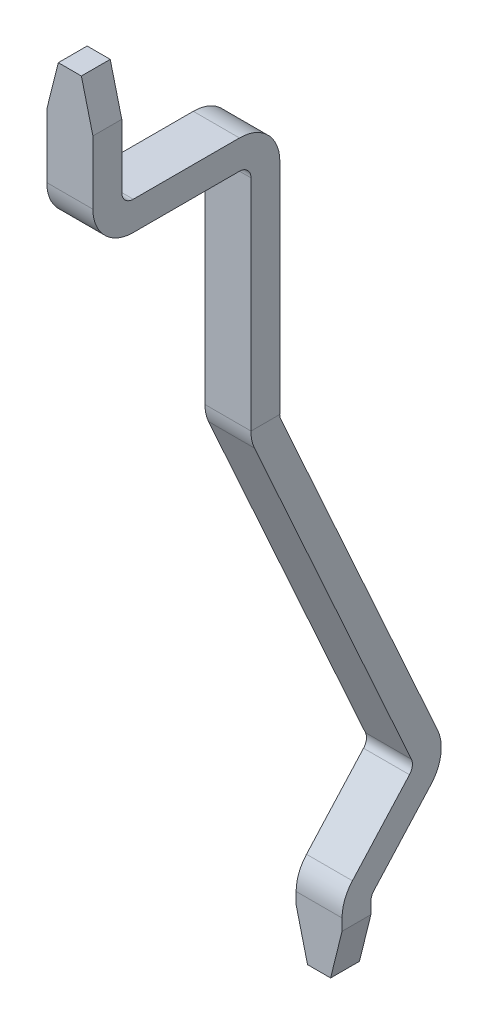
ISO-10303-21;
HEADER;
FILE_DESCRIPTION(('STEP AP214'),'2;1');
FILE_NAME('part.step','',(''),(''),'','','');
FILE_SCHEMA(('AUTOMOTIVE_DESIGN { 1 0 10303 214 1 1 1 1 }'));
ENDSEC;
DATA;
#1=APPLICATION_CONTEXT('core data for automotive mechanical design processes');
#2=APPLICATION_PROTOCOL_DEFINITION('international standard','automotive_design',2000,#1);
#3=PRODUCT_CONTEXT('',#1,'mechanical');
#4=PRODUCT('Part','Part','',(#3));
#5=PRODUCT_RELATED_PRODUCT_CATEGORY('part','',(#4));
#6=PRODUCT_DEFINITION_FORMATION('','',#4);
#7=PRODUCT_DEFINITION_CONTEXT('part definition',#1,'design');
#8=PRODUCT_DEFINITION('design','',#6,#7);
#9=PRODUCT_DEFINITION_SHAPE('','',#8);
#10=(LENGTH_UNIT() NAMED_UNIT(*) SI_UNIT(.MILLI.,.METRE.));
#11=(NAMED_UNIT(*) PLANE_ANGLE_UNIT() SI_UNIT($,.RADIAN.));
#12=(NAMED_UNIT(*) SI_UNIT($,.STERADIAN.) SOLID_ANGLE_UNIT());
#13=UNCERTAINTY_MEASURE_WITH_UNIT(LENGTH_MEASURE(1.E-05),#10,'distance_accuracy_value','');
#14=(GEOMETRIC_REPRESENTATION_CONTEXT(3) GLOBAL_UNCERTAINTY_ASSIGNED_CONTEXT((#13)) GLOBAL_UNIT_ASSIGNED_CONTEXT((#10,
#11,#12)) REPRESENTATION_CONTEXT('',''));
#15=CARTESIAN_POINT('',(0.,0.,0.));
#16=DIRECTION('',(0.,0.,1.));
#17=DIRECTION('',(1.,0.,0.));
#18=AXIS2_PLACEMENT_3D('',#15,#16,#17);
#19=CARTESIAN_POINT('',(0.80000000000001,4.575,1.945));
#20=DIRECTION('',(0.,-1.,0.));
#21=DIRECTION('',(0.,0.,-1.));
#22=AXIS2_PLACEMENT_3D('',#19,#20,#21);
#23=PLANE('',#22);
#24=DIRECTION('',(0.,0.,1.));
#25=VECTOR('',#24,1.);
#26=CARTESIAN_POINT('',(0.70000000000001,4.575,8.99552393868072));
#27=LINE('',#26,#25);
#28=CARTESIAN_POINT('',(0.70000000000001,4.575,1.82));
#29=VERTEX_POINT('',#28);
#30=CARTESIAN_POINT('',(0.70000000000001,4.575,2.07));
#31=VERTEX_POINT('',#30);
#32=EDGE_CURVE('E264',#29,#31,#27,.T.);
#33=ORIENTED_EDGE('',*,*,#32,.T.);
#34=DIRECTION('',(-1.,0.,0.));
#35=VECTOR('',#34,1.);
#36=CARTESIAN_POINT('',(1.00000000000001,4.575,2.07));
#37=LINE('',#36,#35);
#38=CARTESIAN_POINT('',(0.90000000000001,4.575,2.07));
#39=VERTEX_POINT('',#38);
#40=EDGE_CURVE('E235',#31,#39,#37,.F.);
#41=ORIENTED_EDGE('',*,*,#40,.T.);
#42=DIRECTION('',(0.,0.,1.));
#43=VECTOR('',#42,1.);
#44=CARTESIAN_POINT('',(0.90000000000001,4.575,8.99552883706733));
#45=LINE('',#44,#43);
#46=CARTESIAN_POINT('',(0.90000000000001,4.575,1.82));
#47=VERTEX_POINT('',#46);
#48=EDGE_CURVE('E214',#47,#39,#45,.T.);
#49=ORIENTED_EDGE('',*,*,#48,.F.);
#50=DIRECTION('',(1.,0.,0.));
#51=VECTOR('',#50,1.);
#52=CARTESIAN_POINT('',(0.60000000000001,4.575,1.82));
#53=LINE('',#52,#51);
#54=EDGE_CURVE('E251',#47,#29,#53,.F.);
#55=ORIENTED_EDGE('',*,*,#54,.T.);
#56=EDGE_LOOP('',(#33,#41,#49,#55));
#57=FACE_BOUND('',#56,.T.);
#58=ADVANCED_FACE('F17',(#57),#23,.F.);
#59=CARTESIAN_POINT('',(0.70000000000001,4.575,8.99552393868072));
#60=DIRECTION('',(0.970142500145331,-0.242535625036336,0.));
#61=DIRECTION('',(0.242535625036336,0.970142500145331,0.));
#62=AXIS2_PLACEMENT_3D('',#59,#60,#61);
#63=PLANE('',#62);
#64=DIRECTION('',(0.242535625036333,0.970142500145332,0.));
#65=VECTOR('',#64,1.);
#66=CARTESIAN_POINT('',(0.60000000000001,4.175,2.07));
#67=LINE('',#66,#65);
#68=CARTESIAN_POINT('',(0.60000000000001,4.175,2.07));
#69=VERTEX_POINT('',#68);
#70=EDGE_CURVE('E202',#69,#31,#67,.T.);
#71=ORIENTED_EDGE('',*,*,#70,.T.);
#72=ORIENTED_EDGE('',*,*,#32,.F.);
#73=DIRECTION('',(-0.242535625036333,-0.970142500145332,0.));
#74=VECTOR('',#73,1.);
#75=CARTESIAN_POINT('',(0.70000000000001,4.575,1.82));
#76=LINE('',#75,#74);
#77=CARTESIAN_POINT('',(0.60000000000001,4.175,1.82));
#78=VERTEX_POINT('',#77);
#79=EDGE_CURVE('E231',#29,#78,#76,.T.);
#80=ORIENTED_EDGE('',*,*,#79,.T.);
#81=DIRECTION('',(0.,0.,1.));
#82=VECTOR('',#81,1.);
#83=CARTESIAN_POINT('',(0.60000000000001,4.175,2.07));
#84=LINE('',#83,#82);
#85=EDGE_CURVE('E242',#78,#69,#84,.T.);
#86=ORIENTED_EDGE('',*,*,#85,.T.);
#87=EDGE_LOOP('',(#71,#72,#80,#86));
#88=FACE_BOUND('',#87,.T.);
#89=ADVANCED_FACE('F401',(#88),#63,.F.);
#90=CARTESIAN_POINT('',(0.60000000000001,4.575,1.82));
#91=DIRECTION('',(0.,0.,1.));
#92=DIRECTION('',(0.,-1.,0.));
#93=AXIS2_PLACEMENT_3D('',#90,#91,#92);
#94=PLANE('',#93);
#95=ORIENTED_EDGE('',*,*,#79,.F.);
#96=ORIENTED_EDGE('',*,*,#54,.F.);
#97=DIRECTION('',(-0.242535625036336,0.970142500145331,0.));
#98=VECTOR('',#97,1.);
#99=CARTESIAN_POINT('',(0.90000000000001,4.575,1.82));
#100=LINE('',#99,#98);
#101=CARTESIAN_POINT('',(1.00000000000001,4.175,1.82));
#102=VERTEX_POINT('',#101);
#103=EDGE_CURVE('E232',#102,#47,#100,.T.);
#104=ORIENTED_EDGE('',*,*,#103,.F.);
#105=DIRECTION('',(0.,1.,0.));
#106=VECTOR('',#105,1.);
#107=CARTESIAN_POINT('',(1.00000000000001,4.575,1.82));
#108=LINE('',#107,#106);
#109=CARTESIAN_POINT('',(1.00000000000001,3.625,1.82));
#110=VERTEX_POINT('',#109);
#111=EDGE_CURVE('E221',#102,#110,#108,.F.);
#112=ORIENTED_EDGE('',*,*,#111,.T.);
#113=DIRECTION('',(1.,0.,0.));
#114=VECTOR('',#113,1.);
#115=CARTESIAN_POINT('',(0.80000000000001,3.625,1.81999999999999));
#116=LINE('',#115,#114);
#117=CARTESIAN_POINT('',(0.60000000000001,3.625,1.82));
#118=VERTEX_POINT('',#117);
#119=EDGE_CURVE('E229',#110,#118,#116,.F.);
#120=ORIENTED_EDGE('',*,*,#119,.T.);
#121=DIRECTION('',(0.,1.,0.));
#122=VECTOR('',#121,1.);
#123=CARTESIAN_POINT('',(0.60000000000001,4.575,1.82));
#124=LINE('',#123,#122);
#125=EDGE_CURVE('E246',#118,#78,#124,.T.);
#126=ORIENTED_EDGE('',*,*,#125,.T.);
#127=EDGE_LOOP('',(#95,#96,#104,#112,#120,#126));
#128=FACE_BOUND('',#127,.T.);
#129=ADVANCED_FACE('F396',(#128),#94,.F.);
#130=CARTESIAN_POINT('',(0.80000000000001,3.625,1.72));
#131=DIRECTION('',(1.,0.,0.));
#132=DIRECTION('',(0.,1.,0.));
#133=AXIS2_PLACEMENT_3D('',#130,#131,#132);
#134=CYLINDRICAL_SURFACE('',#133,0.0999999999999946);
#135=ORIENTED_EDGE('',*,*,#119,.F.);
#136=CARTESIAN_POINT('',(1.00000000000001,3.625,1.72));
#137=DIRECTION('',(1.,0.,0.));
#138=DIRECTION('',(0.,1.,0.));
#139=AXIS2_PLACEMENT_3D('',#136,#137,#138);
#140=CIRCLE('',#139,0.0999999999999946);
#141=CARTESIAN_POINT('',(1.00000000000001,3.525,1.72));
#142=VERTEX_POINT('',#141);
#143=EDGE_CURVE('E335',#110,#142,#140,.T.);
#144=ORIENTED_EDGE('',*,*,#143,.T.);
#145=DIRECTION('',(1.,0.,0.));
#146=VECTOR('',#145,1.);
#147=CARTESIAN_POINT('',(0.60000000000001,3.525,1.72));
#148=LINE('',#147,#146);
#149=CARTESIAN_POINT('',(0.60000000000001,3.525,1.72));
#150=VERTEX_POINT('',#149);
#151=EDGE_CURVE('E227',#142,#150,#148,.F.);
#152=ORIENTED_EDGE('',*,*,#151,.T.);
#153=CARTESIAN_POINT('',(0.60000000000001,3.625,1.72));
#154=DIRECTION('',(1.,0.,0.));
#155=DIRECTION('',(0.,1.,0.));
#156=AXIS2_PLACEMENT_3D('',#153,#154,#155);
#157=CIRCLE('',#156,0.0999999999999946);
#158=EDGE_CURVE('E340',#150,#118,#157,.F.);
#159=ORIENTED_EDGE('',*,*,#158,.T.);
#160=EDGE_LOOP('',(#135,#144,#152,#159));
#161=FACE_BOUND('',#160,.T.);
#162=ADVANCED_FACE('F393',(#161),#134,.F.);
#163=CARTESIAN_POINT('',(0.60000000000001,3.525,1.72));
#164=DIRECTION('',(0.,-1.,0.));
#165=DIRECTION('',(0.,0.,-1.));
#166=AXIS2_PLACEMENT_3D('',#163,#164,#165);
#167=PLANE('',#166);
#168=ORIENTED_EDGE('',*,*,#151,.F.);
#169=DIRECTION('',(0.,0.,1.));
#170=VECTOR('',#169,1.);
#171=CARTESIAN_POINT('',(1.00000000000001,3.525,1.82));
#172=LINE('',#171,#170);
#173=CARTESIAN_POINT('',(1.00000000000001,3.525,0.800000000000004));
#174=VERTEX_POINT('',#173);
#175=EDGE_CURVE('E334',#142,#174,#172,.F.);
#176=ORIENTED_EDGE('',*,*,#175,.T.);
#177=DIRECTION('',(-1.,0.,0.));
#178=VECTOR('',#177,1.);
#179=CARTESIAN_POINT('',(0.80000000000001,3.525,0.800000000000004));
#180=LINE('',#179,#178);
#181=CARTESIAN_POINT('',(0.60000000000001,3.525,0.800000000000004));
#182=VERTEX_POINT('',#181);
#183=EDGE_CURVE('E178',#182,#174,#180,.F.);
#184=ORIENTED_EDGE('',*,*,#183,.F.);
#185=DIRECTION('',(0.,0.,1.));
#186=VECTOR('',#185,1.);
#187=CARTESIAN_POINT('',(0.60000000000001,3.525,2.07));
#188=LINE('',#187,#186);
#189=EDGE_CURVE('E343',#182,#150,#188,.T.);
#190=ORIENTED_EDGE('',*,*,#189,.T.);
#191=EDGE_LOOP('',(#168,#176,#184,#190));
#192=FACE_BOUND('',#191,.T.);
#193=ADVANCED_FACE('F384',(#192),#167,.F.);
#194=CARTESIAN_POINT('',(0.80000000000001,3.175,0.800000000000004));
#195=DIRECTION('',(-1.,0.,0.));
#196=DIRECTION('',(0.,-1.,0.));
#197=AXIS2_PLACEMENT_3D('',#194,#195,#196);
#198=CYLINDRICAL_SURFACE('',#197,0.350000000000005);
#199=CARTESIAN_POINT('',(1.00000000000001,3.175,0.800000000000004));
#200=DIRECTION('',(-1.,0.,0.));
#201=DIRECTION('',(0.,-1.,0.));
#202=AXIS2_PLACEMENT_3D('',#199,#200,#201);
#203=CIRCLE('',#202,0.350000000000005);
#204=CARTESIAN_POINT('',(1.00000000000001,3.175,0.45));
#205=VERTEX_POINT('',#204);
#206=EDGE_CURVE('E330',#174,#205,#203,.T.);
#207=ORIENTED_EDGE('',*,*,#206,.T.);
#208=DIRECTION('',(1.,0.,0.));
#209=VECTOR('',#208,1.);
#210=CARTESIAN_POINT('',(0.60000000000001,3.175,0.45));
#211=LINE('',#210,#209);
#212=CARTESIAN_POINT('',(0.60000000000001,3.175,0.45));
#213=VERTEX_POINT('',#212);
#214=EDGE_CURVE('E218',#205,#213,#211,.F.);
#215=ORIENTED_EDGE('',*,*,#214,.T.);
#216=CARTESIAN_POINT('',(0.60000000000001,3.175,0.800000000000004));
#217=DIRECTION('',(-1.,0.,0.));
#218=DIRECTION('',(0.,-1.,0.));
#219=AXIS2_PLACEMENT_3D('',#216,#217,#218);
#220=CIRCLE('',#219,0.350000000000005);
#221=EDGE_CURVE('E188',#213,#182,#220,.F.);
#222=ORIENTED_EDGE('',*,*,#221,.T.);
#223=ORIENTED_EDGE('',*,*,#183,.T.);
#224=EDGE_LOOP('',(#207,#215,#222,#223));
#225=FACE_BOUND('',#224,.T.);
#226=ADVANCED_FACE('F389',(#225),#198,.T.);
#227=CARTESIAN_POINT('',(0.60000000000001,3.175,0.45));
#228=DIRECTION('',(0.,0.,1.));
#229=DIRECTION('',(0.,-1.,0.));
#230=AXIS2_PLACEMENT_3D('',#227,#228,#229);
#231=PLANE('',#230);
#232=ORIENTED_EDGE('',*,*,#214,.F.);
#233=DIRECTION('',(0.,1.,0.));
#234=VECTOR('',#233,1.);
#235=CARTESIAN_POINT('',(1.00000000000001,4.575,0.449999999999999));
#236=LINE('',#235,#234);
#237=CARTESIAN_POINT('',(1.00000000000001,1.275,0.449999999999999));
#238=VERTEX_POINT('',#237);
#239=EDGE_CURVE('E333',#205,#238,#236,.F.);
#240=ORIENTED_EDGE('',*,*,#239,.T.);
#241=DIRECTION('',(1.,0.,0.));
#242=VECTOR('',#241,1.);
#243=CARTESIAN_POINT('',(0.999,1.275,0.449999999999998));
#244=LINE('',#243,#242);
#245=CARTESIAN_POINT('',(0.999000000000006,1.275,0.449999999999999));
#246=VERTEX_POINT('',#245);
#247=EDGE_CURVE('E224',#246,#238,#244,.T.);
#248=ORIENTED_EDGE('',*,*,#247,.F.);
#249=DIRECTION('',(1.,0.,0.));
#250=VECTOR('',#249,1.);
#251=CARTESIAN_POINT('',(0.60000000000001,1.275,0.45));
#252=LINE('',#251,#250);
#253=CARTESIAN_POINT('',(0.601000000000015,1.275,0.449999999999999));
#254=VERTEX_POINT('',#253);
#255=EDGE_CURVE('E174',#254,#246,#252,.T.);
#256=ORIENTED_EDGE('',*,*,#255,.F.);
#257=DIRECTION('',(1.,0.,0.));
#258=VECTOR('',#257,1.);
#259=CARTESIAN_POINT('',(0.601000000000014,1.275,0.45));
#260=LINE('',#259,#258);
#261=CARTESIAN_POINT('',(0.60000000000001,1.275,0.45));
#262=VERTEX_POINT('',#261);
#263=EDGE_CURVE('E20',#262,#254,#260,.T.);
#264=ORIENTED_EDGE('',*,*,#263,.F.);
#265=DIRECTION('',(0.,1.,0.));
#266=VECTOR('',#265,1.);
#267=CARTESIAN_POINT('',(0.60000000000001,4.575,0.45));
#268=LINE('',#267,#266);
#269=EDGE_CURVE('E172',#262,#213,#268,.T.);
#270=ORIENTED_EDGE('',*,*,#269,.T.);
#271=EDGE_LOOP('',(#232,#240,#248,#256,#264,#270));
#272=FACE_BOUND('',#271,.T.);
#273=ADVANCED_FACE('F171',(#272),#231,.F.);
#274=CARTESIAN_POINT('',(1.00000000000001,3.275,1.72));
#275=DIRECTION('',(0.,1.,0.));
#276=DIRECTION('',(0.,0.,1.));
#277=AXIS2_PLACEMENT_3D('',#274,#275,#276);
#278=PLANE('',#277);
#279=DIRECTION('',(1.,0.,0.));
#280=VECTOR('',#279,1.);
#281=CARTESIAN_POINT('',(0.80000000000001,3.27500000000001,1.72));
#282=LINE('',#281,#280);
#283=CARTESIAN_POINT('',(0.60000000000001,3.275,1.72));
#284=VERTEX_POINT('',#283);
#285=CARTESIAN_POINT('',(1.00000000000001,3.275,1.72));
#286=VERTEX_POINT('',#285);
#287=EDGE_CURVE('E203',#284,#286,#282,.T.);
#288=ORIENTED_EDGE('',*,*,#287,.F.);
#289=DIRECTION('',(0.,0.,1.));
#290=VECTOR('',#289,1.);
#291=CARTESIAN_POINT('',(0.60000000000001,3.275,2.07));
#292=LINE('',#291,#290);
#293=CARTESIAN_POINT('',(0.60000000000001,3.275,0.800000000000004));
#294=VERTEX_POINT('',#293);
#295=EDGE_CURVE('E194',#284,#294,#292,.F.);
#296=ORIENTED_EDGE('',*,*,#295,.T.);
#297=DIRECTION('',(-1.,0.,0.));
#298=VECTOR('',#297,1.);
#299=CARTESIAN_POINT('',(0.80000000000001,3.275,0.800000000000004));
#300=LINE('',#299,#298);
#301=CARTESIAN_POINT('',(1.00000000000001,3.275,0.800000000000004));
#302=VERTEX_POINT('',#301);
#303=EDGE_CURVE('E219',#294,#302,#300,.F.);
#304=ORIENTED_EDGE('',*,*,#303,.T.);
#305=DIRECTION('',(0.,0.,1.));
#306=VECTOR('',#305,1.);
#307=CARTESIAN_POINT('',(1.00000000000001,3.275,1.82));
#308=LINE('',#307,#306);
#309=EDGE_CURVE('E325',#302,#286,#308,.T.);
#310=ORIENTED_EDGE('',*,*,#309,.T.);
#311=EDGE_LOOP('',(#288,#296,#304,#310));
#312=FACE_BOUND('',#311,.T.);
#313=ADVANCED_FACE('F535',(#312),#278,.F.);
#314=CARTESIAN_POINT('',(0.80000000000001,3.625,1.72));
#315=DIRECTION('',(1.,0.,0.));
#316=DIRECTION('',(0.,1.,0.));
#317=AXIS2_PLACEMENT_3D('',#314,#315,#316);
#318=CYLINDRICAL_SURFACE('',#317,0.349999999999995);
#319=CARTESIAN_POINT('',(0.60000000000001,3.625,1.72));
#320=DIRECTION('',(1.,0.,0.));
#321=DIRECTION('',(0.,1.,0.));
#322=AXIS2_PLACEMENT_3D('',#319,#320,#321);
#323=CIRCLE('',#322,0.349999999999995);
#324=CARTESIAN_POINT('',(0.60000000000001,3.625,2.07));
#325=VERTEX_POINT('',#324);
#326=EDGE_CURVE('E196',#325,#284,#323,.T.);
#327=ORIENTED_EDGE('',*,*,#326,.T.);
#328=ORIENTED_EDGE('',*,*,#287,.T.);
#329=CARTESIAN_POINT('',(1.00000000000001,3.625,1.72));
#330=DIRECTION('',(1.,0.,0.));
#331=DIRECTION('',(0.,1.,0.));
#332=AXIS2_PLACEMENT_3D('',#329,#330,#331);
#333=CIRCLE('',#332,0.349999999999995);
#334=CARTESIAN_POINT('',(1.00000000000001,3.625,2.07));
#335=VERTEX_POINT('',#334);
#336=EDGE_CURVE('E322',#286,#335,#333,.F.);
#337=ORIENTED_EDGE('',*,*,#336,.T.);
#338=DIRECTION('',(-1.,0.,0.));
#339=VECTOR('',#338,1.);
#340=CARTESIAN_POINT('',(1.00000000000001,3.625,2.07));
#341=LINE('',#340,#339);
#342=EDGE_CURVE('E199',#335,#325,#341,.T.);
#343=ORIENTED_EDGE('',*,*,#342,.T.);
#344=EDGE_LOOP('',(#327,#328,#337,#343));
#345=FACE_BOUND('',#344,.T.);
#346=ADVANCED_FACE('F532',(#345),#318,.T.);
#347=CARTESIAN_POINT('',(1.00000000000001,4.575,2.07));
#348=DIRECTION('',(0.,0.,-1.));
#349=DIRECTION('',(-1.,0.,0.));
#350=AXIS2_PLACEMENT_3D('',#347,#348,#349);
#351=PLANE('',#350);
#352=ORIENTED_EDGE('',*,*,#70,.F.);
#353=DIRECTION('',(0.,1.,0.));
#354=VECTOR('',#353,1.);
#355=CARTESIAN_POINT('',(0.60000000000001,4.575,2.07));
#356=LINE('',#355,#354);
#357=EDGE_CURVE('E245',#69,#325,#356,.F.);
#358=ORIENTED_EDGE('',*,*,#357,.T.);
#359=ORIENTED_EDGE('',*,*,#342,.F.);
#360=DIRECTION('',(0.,1.,0.));
#361=VECTOR('',#360,1.);
#362=CARTESIAN_POINT('',(1.00000000000001,4.575,2.07));
#363=LINE('',#362,#361);
#364=CARTESIAN_POINT('',(1.00000000000001,4.175,2.07));
#365=VERTEX_POINT('',#364);
#366=EDGE_CURVE('E208',#335,#365,#363,.T.);
#367=ORIENTED_EDGE('',*,*,#366,.T.);
#368=DIRECTION('',(-0.242535625036336,0.970142500145331,0.));
#369=VECTOR('',#368,1.);
#370=CARTESIAN_POINT('',(0.90000000000001,4.575,2.07));
#371=LINE('',#370,#369);
#372=EDGE_CURVE('E211',#39,#365,#371,.F.);
#373=ORIENTED_EDGE('',*,*,#372,.F.);
#374=ORIENTED_EDGE('',*,*,#40,.F.);
#375=EDGE_LOOP('',(#352,#358,#359,#367,#373,#374));
#376=FACE_BOUND('',#375,.T.);
#377=ADVANCED_FACE('F528',(#376),#351,.F.);
#378=CARTESIAN_POINT('',(0.90000000000001,4.575,8.99552883706733));
#379=DIRECTION('',(0.970142500145331,0.242535625036336,0.));
#380=DIRECTION('',(-0.242535625036336,0.970142500145331,0.));
#381=AXIS2_PLACEMENT_3D('',#378,#379,#380);
#382=PLANE('',#381);
#383=ORIENTED_EDGE('',*,*,#372,.T.);
#384=DIRECTION('',(0.,0.,1.));
#385=VECTOR('',#384,1.);
#386=CARTESIAN_POINT('',(1.00000000000001,4.175,1.82));
#387=LINE('',#386,#385);
#388=EDGE_CURVE('E204',#365,#102,#387,.F.);
#389=ORIENTED_EDGE('',*,*,#388,.T.);
#390=ORIENTED_EDGE('',*,*,#103,.T.);
#391=ORIENTED_EDGE('',*,*,#48,.T.);
#392=EDGE_LOOP('',(#383,#389,#390,#391));
#393=FACE_BOUND('',#392,.T.);
#394=ADVANCED_FACE('F525',(#393),#382,.T.);
#395=CARTESIAN_POINT('',(0.60000000000001,4.575,2.07));
#396=DIRECTION('',(1.,0.,0.));
#397=DIRECTION('',(0.,1.,0.));
#398=AXIS2_PLACEMENT_3D('',#395,#396,#397);
#399=PLANE('',#398);
#400=ORIENTED_EDGE('',*,*,#85,.F.);
#401=ORIENTED_EDGE('',*,*,#125,.F.);
#402=ORIENTED_EDGE('',*,*,#158,.F.);
#403=ORIENTED_EDGE('',*,*,#189,.F.);
#404=ORIENTED_EDGE('',*,*,#221,.F.);
#405=ORIENTED_EDGE('',*,*,#269,.F.);
#406=DIRECTION('',(0.,0.,1.));
#407=VECTOR('',#406,1.);
#408=CARTESIAN_POINT('',(0.60000000000001,1.275,2.07));
#409=LINE('',#408,#407);
#410=CARTESIAN_POINT('',(0.600000000000012,1.275,0.7));
#411=VERTEX_POINT('',#410);
#412=EDGE_CURVE('E184',#411,#262,#409,.F.);
#413=ORIENTED_EDGE('',*,*,#412,.F.);
#414=DIRECTION('',(0.,1.,0.));
#415=VECTOR('',#414,1.);
#416=CARTESIAN_POINT('',(0.600000000000014,3.175,0.7));
#417=LINE('',#416,#415);
#418=CARTESIAN_POINT('',(0.600000000000012,3.175,0.7));
#419=VERTEX_POINT('',#418);
#420=EDGE_CURVE('E207',#411,#419,#417,.T.);
#421=ORIENTED_EDGE('',*,*,#420,.T.);
#422=CARTESIAN_POINT('',(0.60000000000001,3.175,0.800000000000004));
#423=DIRECTION('',(-1.,0.,0.));
#424=DIRECTION('',(0.,-1.,0.));
#425=AXIS2_PLACEMENT_3D('',#422,#423,#424);
#426=CIRCLE('',#425,0.100000000000005);
#427=EDGE_CURVE('E222',#419,#294,#426,.F.);
#428=ORIENTED_EDGE('',*,*,#427,.T.);
#429=ORIENTED_EDGE('',*,*,#295,.F.);
#430=ORIENTED_EDGE('',*,*,#326,.F.);
#431=ORIENTED_EDGE('',*,*,#357,.F.);
#432=EDGE_LOOP('',(#400,#401,#402,#403,#404,#405,#413,#421,#428,#429,#430,#431));
#433=FACE_BOUND('',#432,.T.);
#434=ADVANCED_FACE('F182',(#433),#399,.F.);
#435=CARTESIAN_POINT('',(0.80000000000001,3.175,0.800000000000004));
#436=DIRECTION('',(-1.,0.,0.));
#437=DIRECTION('',(0.,-1.,0.));
#438=AXIS2_PLACEMENT_3D('',#435,#436,#437);
#439=CYLINDRICAL_SURFACE('',#438,0.100000000000005);
#440=ORIENTED_EDGE('',*,*,#303,.F.);
#441=ORIENTED_EDGE('',*,*,#427,.F.);
#442=DIRECTION('',(-1.,0.,0.));
#443=VECTOR('',#442,1.);
#444=CARTESIAN_POINT('',(1.00000000000001,3.175,0.7));
#445=LINE('',#444,#443);
#446=CARTESIAN_POINT('',(1.00000000000001,3.175,0.7));
#447=VERTEX_POINT('',#446);
#448=EDGE_CURVE('E371',#419,#447,#445,.F.);
#449=ORIENTED_EDGE('',*,*,#448,.T.);
#450=CARTESIAN_POINT('',(1.00000000000001,3.175,0.800000000000004));
#451=DIRECTION('',(-1.,0.,0.));
#452=DIRECTION('',(0.,-1.,0.));
#453=AXIS2_PLACEMENT_3D('',#450,#451,#452);
#454=CIRCLE('',#453,0.100000000000005);
#455=EDGE_CURVE('E326',#447,#302,#454,.F.);
#456=ORIENTED_EDGE('',*,*,#455,.T.);
#457=EDGE_LOOP('',(#440,#441,#449,#456));
#458=FACE_BOUND('',#457,.T.);
#459=ADVANCED_FACE('F519',(#458),#439,.F.);
#460=CARTESIAN_POINT('',(1.00000000000001,4.575,1.82));
#461=DIRECTION('',(-1.,0.,0.));
#462=DIRECTION('',(0.,0.,1.));
#463=AXIS2_PLACEMENT_3D('',#460,#461,#462);
#464=PLANE('',#463);
#465=ORIENTED_EDGE('',*,*,#366,.F.);
#466=ORIENTED_EDGE('',*,*,#336,.F.);
#467=ORIENTED_EDGE('',*,*,#309,.F.);
#468=ORIENTED_EDGE('',*,*,#455,.F.);
#469=DIRECTION('',(0.,1.,0.));
#470=VECTOR('',#469,1.);
#471=CARTESIAN_POINT('',(1.00000000000001,3.175,0.7));
#472=LINE('',#471,#470);
#473=CARTESIAN_POINT('',(1.00000000000001,1.275,0.7));
#474=VERTEX_POINT('',#473);
#475=EDGE_CURVE('E359',#447,#474,#472,.F.);
#476=ORIENTED_EDGE('',*,*,#475,.T.);
#477=DIRECTION('',(0.,0.,1.));
#478=VECTOR('',#477,1.);
#479=CARTESIAN_POINT('',(1.00000000000001,1.275,1.82));
#480=LINE('',#479,#478);
#481=EDGE_CURVE('E329',#238,#474,#480,.T.);
#482=ORIENTED_EDGE('',*,*,#481,.F.);
#483=ORIENTED_EDGE('',*,*,#239,.F.);
#484=ORIENTED_EDGE('',*,*,#206,.F.);
#485=ORIENTED_EDGE('',*,*,#175,.F.);
#486=ORIENTED_EDGE('',*,*,#143,.F.);
#487=ORIENTED_EDGE('',*,*,#111,.F.);
#488=ORIENTED_EDGE('',*,*,#388,.F.);
#489=EDGE_LOOP('',(#465,#466,#467,#468,#476,#482,#483,#484,#485,#486,#487,#488));
#490=FACE_BOUND('',#489,.T.);
#491=ADVANCED_FACE('F356',(#490),#464,.F.);
#492=CARTESIAN_POINT('',(1.00000000000001,3.175,0.7));
#493=DIRECTION('',(0.,0.,-1.));
#494=DIRECTION('',(-1.,0.,0.));
#495=AXIS2_PLACEMENT_3D('',#492,#493,#494);
#496=PLANE('',#495);
#497=ORIENTED_EDGE('',*,*,#448,.F.);
#498=ORIENTED_EDGE('',*,*,#420,.F.);
#499=DIRECTION('',(-1.,0.,0.));
#500=VECTOR('',#499,1.);
#501=CARTESIAN_POINT('',(1.00000000000001,1.275,0.7));
#502=LINE('',#501,#500);
#503=CARTESIAN_POINT('',(0.601000000000017,1.275,0.699999999999999));
#504=VERTEX_POINT('',#503);
#505=EDGE_CURVE('E193',#411,#504,#502,.F.);
#506=ORIENTED_EDGE('',*,*,#505,.T.);
#507=DIRECTION('',(1.,0.,0.));
#508=VECTOR('',#507,1.);
#509=CARTESIAN_POINT('',(0.80000000000001,1.275,0.699999999999998));
#510=LINE('',#509,#508);
#511=CARTESIAN_POINT('',(0.999000000000007,1.275,0.699999999999999));
#512=VERTEX_POINT('',#511);
#513=EDGE_CURVE('E316',#512,#504,#510,.F.);
#514=ORIENTED_EDGE('',*,*,#513,.F.);
#515=DIRECTION('',(-1.,0.,0.));
#516=VECTOR('',#515,1.);
#517=CARTESIAN_POINT('',(1.00000000000001,1.275,0.7));
#518=LINE('',#517,#516);
#519=EDGE_CURVE('E317',#512,#474,#518,.F.);
#520=ORIENTED_EDGE('',*,*,#519,.T.);
#521=ORIENTED_EDGE('',*,*,#475,.F.);
#522=EDGE_LOOP('',(#497,#498,#506,#514,#520,#521));
#523=FACE_BOUND('',#522,.T.);
#524=ADVANCED_FACE('F512',(#523),#496,.F.);
#525=CARTESIAN_POINT('',(0.800000000000009,-3.275,-0.215));
#526=DIRECTION('',(0.,-1.,0.));
#527=DIRECTION('',(0.,0.,-1.));
#528=AXIS2_PLACEMENT_3D('',#525,#526,#527);
#529=PLANE('',#528);
#530=DIRECTION('',(1.,0.,0.));
#531=VECTOR('',#530,1.);
#532=CARTESIAN_POINT('',(1.00000000000001,-3.275,-0.0900000000000004));
#533=LINE('',#532,#531);
#534=CARTESIAN_POINT('',(0.90000000000001,-3.275,-0.0900000000000002));
#535=VERTEX_POINT('',#534);
#536=CARTESIAN_POINT('',(0.70000000000001,-3.275,-0.0900000000000002));
#537=VERTEX_POINT('',#536);
#538=EDGE_CURVE('E638',#535,#537,#533,.F.);
#539=ORIENTED_EDGE('',*,*,#538,.T.);
#540=DIRECTION('',(0.,0.,1.));
#541=VECTOR('',#540,1.);
#542=CARTESIAN_POINT('',(0.70000000000001,-3.275,-7.84552393868072));
#543=LINE('',#542,#541);
#544=CARTESIAN_POINT('',(0.70000000000001,-3.275,-0.34));
#545=VERTEX_POINT('',#544);
#546=EDGE_CURVE('E320',#537,#545,#543,.F.);
#547=ORIENTED_EDGE('',*,*,#546,.T.);
#548=DIRECTION('',(1.,0.,0.));
#549=VECTOR('',#548,1.);
#550=CARTESIAN_POINT('',(0.60000000000001,-3.275,-0.34));
#551=LINE('',#550,#549);
#552=CARTESIAN_POINT('',(0.90000000000001,-3.275,-0.34));
#553=VERTEX_POINT('',#552);
#554=EDGE_CURVE('E595',#545,#553,#551,.T.);
#555=ORIENTED_EDGE('',*,*,#554,.T.);
#556=DIRECTION('',(0.,0.,1.));
#557=VECTOR('',#556,1.);
#558=CARTESIAN_POINT('',(0.90000000000001,-3.275,-7.84552393868072));
#559=LINE('',#558,#557);
#560=EDGE_CURVE('E321',#535,#553,#559,.F.);
#561=ORIENTED_EDGE('',*,*,#560,.F.);
#562=EDGE_LOOP('',(#539,#547,#555,#561));
#563=FACE_BOUND('',#562,.T.);
#564=ADVANCED_FACE('F508',(#563),#529,.T.);
#565=CARTESIAN_POINT('',(0.90000000000001,-3.275,-7.84552393868072));
#566=DIRECTION('',(0.970710817842158,-0.240250927415917,0.));
#567=DIRECTION('',(0.240250927415917,0.970710817842158,0.));
#568=AXIS2_PLACEMENT_3D('',#565,#566,#567);
#569=PLANE('',#568);
#570=DIRECTION('',(-0.240250927415917,-0.970710817842158,0.));
#571=VECTOR('',#570,1.);
#572=CARTESIAN_POINT('',(0.999000000000003,-2.875,-0.0900000000000001));
#573=LINE('',#572,#571);
#574=CARTESIAN_POINT('',(0.999000000000003,-2.875,-0.0900000000000001));
#575=VERTEX_POINT('',#574);
#576=EDGE_CURVE('E634',#575,#535,#573,.T.);
#577=ORIENTED_EDGE('',*,*,#576,.T.);
#578=ORIENTED_EDGE('',*,*,#560,.T.);
#579=DIRECTION('',(0.240250927415917,0.970710817842158,0.));
#580=VECTOR('',#579,1.);
#581=CARTESIAN_POINT('',(0.90000000000001,-3.275,-0.34));
#582=LINE('',#581,#580);
#583=CARTESIAN_POINT('',(0.999000000000003,-2.875,-0.34));
#584=VERTEX_POINT('',#583);
#585=EDGE_CURVE('E591',#553,#584,#582,.T.);
#586=ORIENTED_EDGE('',*,*,#585,.T.);
#587=DIRECTION('',(0.,0.,-1.));
#588=VECTOR('',#587,1.);
#589=CARTESIAN_POINT('',(0.999000000000006,-2.875,0.7));
#590=LINE('',#589,#588);
#591=EDGE_CURVE('E581',#575,#584,#590,.T.);
#592=ORIENTED_EDGE('',*,*,#591,.F.);
#593=EDGE_LOOP('',(#577,#578,#586,#592));
#594=FACE_BOUND('',#593,.T.);
#595=ADVANCED_FACE('F505',(#594),#569,.T.);
#596=CARTESIAN_POINT('',(0.999,1.275,-0.95));
#597=DIRECTION('',(0.,1.,0.));
#598=DIRECTION('',(0.,0.,1.));
#599=AXIS2_PLACEMENT_3D('',#596,#597,#598);
#600=PLANE('',#599);
#601=ORIENTED_EDGE('',*,*,#519,.F.);
#602=DIRECTION('',(0.,0.,-1.));
#603=VECTOR('',#602,1.);
#604=CARTESIAN_POINT('',(0.999000000000006,1.275,0.7));
#605=LINE('',#604,#603);
#606=EDGE_CURVE('E306',#246,#512,#605,.F.);
#607=ORIENTED_EDGE('',*,*,#606,.F.);
#608=ORIENTED_EDGE('',*,*,#247,.T.);
#609=ORIENTED_EDGE('',*,*,#481,.T.);
#610=EDGE_LOOP('',(#601,#607,#608,#609));
#611=FACE_BOUND('',#610,.T.);
#612=ADVANCED_FACE('F349',(#611),#600,.F.);
#613=CARTESIAN_POINT('',(0.70000000000001,-3.275,-7.84552393868072));
#614=DIRECTION('',(0.970710817842158,0.240250927415917,0.));
#615=DIRECTION('',(-0.240250927415917,0.970710817842158,0.));
#616=AXIS2_PLACEMENT_3D('',#613,#614,#615);
#617=PLANE('',#616);
#618=DIRECTION('',(-0.240250927415917,0.970710817842158,0.));
#619=VECTOR('',#618,1.);
#620=CARTESIAN_POINT('',(0.70000000000001,-3.275,-0.0900000000000004));
#621=LINE('',#620,#619);
#622=CARTESIAN_POINT('',(0.601000000000017,-2.875,-0.0900000000000001));
#623=VERTEX_POINT('',#622);
#624=EDGE_CURVE('E635',#537,#623,#621,.T.);
#625=ORIENTED_EDGE('',*,*,#624,.T.);
#626=DIRECTION('',(0.,0.,1.));
#627=VECTOR('',#626,1.);
#628=CARTESIAN_POINT('',(0.601000000000014,-2.875,0.7));
#629=LINE('',#628,#627);
#630=CARTESIAN_POINT('',(0.601000000000017,-2.875,-0.34));
#631=VERTEX_POINT('',#630);
#632=EDGE_CURVE('E294',#631,#623,#629,.T.);
#633=ORIENTED_EDGE('',*,*,#632,.F.);
#634=DIRECTION('',(0.240250927415917,-0.970710817842158,0.));
#635=VECTOR('',#634,1.);
#636=CARTESIAN_POINT('',(0.601000000000017,-2.875,-0.34));
#637=LINE('',#636,#635);
#638=EDGE_CURVE('E609',#631,#545,#637,.T.);
#639=ORIENTED_EDGE('',*,*,#638,.T.);
#640=ORIENTED_EDGE('',*,*,#546,.F.);
#641=EDGE_LOOP('',(#625,#633,#639,#640));
#642=FACE_BOUND('',#641,.T.);
#643=ADVANCED_FACE('F498',(#642),#617,.F.);
#644=CARTESIAN_POINT('',(1.00000000000001,-2.775,-0.0900000000000001));
#645=DIRECTION('',(0.,0.,-1.));
#646=DIRECTION('',(0.,1.,0.));
#647=AXIS2_PLACEMENT_3D('',#644,#645,#646);
#648=PLANE('',#647);
#649=DIRECTION('',(0.,1.,0.));
#650=VECTOR('',#649,1.);
#651=CARTESIAN_POINT('',(0.999000000000003,-3.275,-0.0900000000000001));
#652=LINE('',#651,#650);
#653=CARTESIAN_POINT('',(0.999000000000003,-2.775,-0.0900000000000025));
#654=VERTEX_POINT('',#653);
#655=EDGE_CURVE('E587',#654,#575,#652,.F.);
#656=ORIENTED_EDGE('',*,*,#655,.F.);
#657=DIRECTION('',(1.,0.,0.));
#658=VECTOR('',#657,1.);
#659=CARTESIAN_POINT('',(0.80000000000001,-2.775,-0.090000000000005));
#660=LINE('',#659,#658);
#661=CARTESIAN_POINT('',(0.601000000000017,-2.775,-0.0900000000000025));
#662=VERTEX_POINT('',#661);
#663=EDGE_CURVE('E632',#662,#654,#660,.T.);
#664=ORIENTED_EDGE('',*,*,#663,.F.);
#665=DIRECTION('',(0.,1.,0.));
#666=VECTOR('',#665,1.);
#667=CARTESIAN_POINT('',(0.601000000000017,-3.275,-0.0900000000000001));
#668=LINE('',#667,#666);
#669=EDGE_CURVE('E290',#623,#662,#668,.T.);
#670=ORIENTED_EDGE('',*,*,#669,.F.);
#671=ORIENTED_EDGE('',*,*,#624,.F.);
#672=ORIENTED_EDGE('',*,*,#538,.F.);
#673=ORIENTED_EDGE('',*,*,#576,.F.);
#674=EDGE_LOOP('',(#656,#664,#670,#671,#672,#673));
#675=FACE_BOUND('',#674,.T.);
#676=ADVANCED_FACE('F494',(#675),#648,.F.);
#677=CARTESIAN_POINT('',(0.80000000000001,-2.775,-0.44));
#678=DIRECTION('',(1.,0.,0.));
#679=DIRECTION('',(0.,1.,0.));
#680=AXIS2_PLACEMENT_3D('',#677,#678,#679);
#681=CYLINDRICAL_SURFACE('',#680,0.349999999999995);
#682=CARTESIAN_POINT('',(0.999000000000003,-2.775,-0.44));
#683=DIRECTION('',(1.,0.,0.));
#684=DIRECTION('',(0.,1.,0.));
#685=AXIS2_PLACEMENT_3D('',#682,#683,#684);
#686=CIRCLE('',#685,0.349999999999995);
#687=CARTESIAN_POINT('',(0.999000000000003,-2.54075423726739,-0.179944385482999));
#688=VERTEX_POINT('',#687);
#689=EDGE_CURVE('E295',#688,#654,#686,.T.);
#690=ORIENTED_EDGE('',*,*,#689,.F.);
#691=DIRECTION('',(1.,0.,0.));
#692=VECTOR('',#691,1.);
#693=CARTESIAN_POINT('',(1.00000000000001,-2.54075423726739,-0.179944385483));
#694=LINE('',#693,#692);
#695=CARTESIAN_POINT('',(0.601000000000017,-2.54075423726739,-0.179944385482999));
#696=VERTEX_POINT('',#695);
#697=EDGE_CURVE('E629',#688,#696,#694,.F.);
#698=ORIENTED_EDGE('',*,*,#697,.T.);
#699=CARTESIAN_POINT('',(0.601000000000017,-2.775,-0.44));
#700=DIRECTION('',(1.,0.,0.));
#701=DIRECTION('',(0.,1.,0.));
#702=AXIS2_PLACEMENT_3D('',#699,#700,#701);
#703=CIRCLE('',#702,0.349999999999995);
#704=EDGE_CURVE('E288',#662,#696,#703,.F.);
#705=ORIENTED_EDGE('',*,*,#704,.F.);
#706=ORIENTED_EDGE('',*,*,#663,.T.);
#707=EDGE_LOOP('',(#690,#698,#705,#706));
#708=FACE_BOUND('',#707,.T.);
#709=ADVANCED_FACE('F490',(#708),#681,.T.);
#710=CARTESIAN_POINT('',(1.00000000000001,-1.99192736078075,-0.67430160414772));
#711=DIRECTION('',(0.,-0.669273607807463,-0.743016041477155));
#712=DIRECTION('',(0.,0.743016041477155,-0.669273607807463));
#713=AXIS2_PLACEMENT_3D('',#710,#711,#712);
#714=PLANE('',#713);
#715=ORIENTED_EDGE('',*,*,#697,.F.);
#716=DIRECTION('',(0.,-0.743016041477151,0.669273607807469));
#717=VECTOR('',#716,1.);
#718=CARTESIAN_POINT('',(0.999000000000001,-1.99192736078075,-0.67430160414772));
#719=LINE('',#718,#717);
#720=CARTESIAN_POINT('',(0.999000000000001,-1.99192736078075,-0.67430160414772));
#721=VERTEX_POINT('',#720);
#722=EDGE_CURVE('E298',#721,#688,#719,.T.);
#723=ORIENTED_EDGE('',*,*,#722,.F.);
#724=DIRECTION('',(-1.,0.,0.));
#725=VECTOR('',#724,1.);
#726=CARTESIAN_POINT('',(0.80000000000001,-1.99192736078075,-0.67430160414772));
#727=LINE('',#726,#725);
#728=CARTESIAN_POINT('',(0.601000000000019,-1.99192736078075,-0.674301604147719));
#729=VERTEX_POINT('',#728);
#730=EDGE_CURVE('E626',#721,#729,#727,.T.);
#731=ORIENTED_EDGE('',*,*,#730,.T.);
#732=DIRECTION('',(0.,0.743016041477151,-0.669273607807469));
#733=VECTOR('',#732,1.);
#734=CARTESIAN_POINT('',(0.601000000000017,-2.54075423726739,-0.179944385482996));
#735=LINE('',#734,#733);
#736=EDGE_CURVE('E287',#696,#729,#735,.T.);
#737=ORIENTED_EDGE('',*,*,#736,.F.);
#738=EDGE_LOOP('',(#715,#723,#731,#737));
#739=FACE_BOUND('',#738,.T.);
#740=ADVANCED_FACE('F486',(#739),#714,.F.);
#741=CARTESIAN_POINT('',(0.80000000000001,-1.925,-0.6));
#742=DIRECTION('',(-1.,0.,0.));
#743=DIRECTION('',(0.,-1.,0.));
#744=AXIS2_PLACEMENT_3D('',#741,#742,#743);
#745=CYLINDRICAL_SURFACE('',#744,0.100000000000005);
#746=ORIENTED_EDGE('',*,*,#730,.F.);
#747=CARTESIAN_POINT('',(0.999,-1.925,-0.6));
#748=DIRECTION('',(-1.,0.,0.));
#749=DIRECTION('',(0.,-1.,0.));
#750=AXIS2_PLACEMENT_3D('',#747,#748,#749);
#751=CIRCLE('',#750,0.100000000000005);
#752=CARTESIAN_POINT('',(0.999,-1.88387647540836,-0.69115292494024));
#753=VERTEX_POINT('',#752);
#754=EDGE_CURVE('E299',#753,#721,#751,.T.);
#755=ORIENTED_EDGE('',*,*,#754,.F.);
#756=DIRECTION('',(1.,0.,0.));
#757=VECTOR('',#756,1.);
#758=CARTESIAN_POINT('',(1.00000000000001,-1.88387647540836,-0.691152924940239));
#759=LINE('',#758,#757);
#760=CARTESIAN_POINT('',(0.601000000000019,-1.88387647540836,-0.69115292494024));
#761=VERTEX_POINT('',#760);
#762=EDGE_CURVE('E623',#753,#761,#759,.F.);
#763=ORIENTED_EDGE('',*,*,#762,.T.);
#764=CARTESIAN_POINT('',(0.601000000000019,-1.925,-0.6));
#765=DIRECTION('',(-1.,0.,0.));
#766=DIRECTION('',(0.,-1.,0.));
#767=AXIS2_PLACEMENT_3D('',#764,#765,#766);
#768=CIRCLE('',#767,0.100000000000005);
#769=EDGE_CURVE('E285',#729,#761,#768,.F.);
#770=ORIENTED_EDGE('',*,*,#769,.F.);
#771=EDGE_LOOP('',(#746,#755,#763,#770));
#772=FACE_BOUND('',#771,.T.);
#773=ADVANCED_FACE('F482',(#772),#745,.F.);
#774=CARTESIAN_POINT('',(1.00000000000001,1.13106766392928,0.669035237290843));
#775=DIRECTION('',(0.,0.411235245916341,-0.911529249402413));
#776=DIRECTION('',(0.,0.911529249402413,0.411235245916341));
#777=AXIS2_PLACEMENT_3D('',#774,#775,#776);
#778=PLANE('',#777);
#779=ORIENTED_EDGE('',*,*,#762,.F.);
#780=DIRECTION('',(0.,-0.911529249402413,-0.411235245916341));
#781=VECTOR('',#780,1.);
#782=CARTESIAN_POINT('',(0.999000000000006,1.13106766392928,0.669035237290843));
#783=LINE('',#782,#781);
#784=CARTESIAN_POINT('',(0.999000000000006,1.13106766392928,0.669035237290843));
#785=VERTEX_POINT('',#784);
#786=EDGE_CURVE('E302',#785,#753,#783,.T.);
#787=ORIENTED_EDGE('',*,*,#786,.F.);
#788=DIRECTION('',(1.,0.,0.));
#789=VECTOR('',#788,1.);
#790=CARTESIAN_POINT('',(0.80000000000001,1.13106766392928,0.669035237290842));
#791=LINE('',#790,#789);
#792=CARTESIAN_POINT('',(0.601000000000017,1.13106766392928,0.669035237290843));
#793=VERTEX_POINT('',#792);
#794=EDGE_CURVE('E621',#793,#785,#791,.T.);
#795=ORIENTED_EDGE('',*,*,#794,.F.);
#796=DIRECTION('',(0.,0.911529249402413,0.411235245916341));
#797=VECTOR('',#796,1.);
#798=CARTESIAN_POINT('',(0.601000000000019,-1.88387647540836,-0.69115292494024));
#799=LINE('',#798,#797);
#800=EDGE_CURVE('E284',#761,#793,#799,.T.);
#801=ORIENTED_EDGE('',*,*,#800,.F.);
#802=EDGE_LOOP('',(#779,#787,#795,#801));
#803=FACE_BOUND('',#802,.T.);
#804=ADVANCED_FACE('F478',(#803),#778,.F.);
#805=CARTESIAN_POINT('',(0.80000000000001,1.275,0.350000000000003));
#806=DIRECTION('',(1.,0.,0.));
#807=DIRECTION('',(0.,1.,0.));
#808=AXIS2_PLACEMENT_3D('',#805,#806,#807);
#809=CYLINDRICAL_SURFACE('',#808,0.349999999999995);
#810=CARTESIAN_POINT('',(0.999000000000006,1.275,0.350000000000003));
#811=DIRECTION('',(1.,0.,0.));
#812=DIRECTION('',(0.,1.,0.));
#813=AXIS2_PLACEMENT_3D('',#810,#811,#812);
#814=CIRCLE('',#813,0.349999999999995);
#815=EDGE_CURVE('E303',#512,#785,#814,.T.);
#816=ORIENTED_EDGE('',*,*,#815,.F.);
#817=ORIENTED_EDGE('',*,*,#513,.T.);
#818=CARTESIAN_POINT('',(0.60100000000002,1.275,0.350000000000003));
#819=DIRECTION('',(1.,0.,0.));
#820=DIRECTION('',(0.,1.,0.));
#821=AXIS2_PLACEMENT_3D('',#818,#819,#820);
#822=CIRCLE('',#821,0.349999999999995);
#823=EDGE_CURVE('E281',#793,#504,#822,.F.);
#824=ORIENTED_EDGE('',*,*,#823,.F.);
#825=ORIENTED_EDGE('',*,*,#794,.T.);
#826=EDGE_LOOP('',(#816,#817,#824,#825));
#827=FACE_BOUND('',#826,.T.);
#828=ADVANCED_FACE('F475',(#827),#809,.T.);
#829=CARTESIAN_POINT('',(0.601000000000014,1.275,0.7));
#830=DIRECTION('',(0.,1.,0.));
#831=DIRECTION('',(0.,0.,1.));
#832=AXIS2_PLACEMENT_3D('',#829,#830,#831);
#833=PLANE('',#832);
#834=ORIENTED_EDGE('',*,*,#505,.F.);
#835=ORIENTED_EDGE('',*,*,#412,.T.);
#836=ORIENTED_EDGE('',*,*,#263,.T.);
#837=DIRECTION('',(0.,0.,1.));
#838=VECTOR('',#837,1.);
#839=CARTESIAN_POINT('',(0.601000000000014,1.275,0.7));
#840=LINE('',#839,#838);
#841=EDGE_CURVE('E280',#504,#254,#840,.F.);
#842=ORIENTED_EDGE('',*,*,#841,.F.);
#843=EDGE_LOOP('',(#834,#835,#836,#842));
#844=FACE_BOUND('',#843,.T.);
#845=ADVANCED_FACE('F191',(#844),#833,.F.);
#846=CARTESIAN_POINT('',(0.60000000000001,-2.15924576273261,-0.860055614517));
#847=DIRECTION('',(0.,0.669273607807463,0.743016041477155));
#848=DIRECTION('',(0.,-0.743016041477155,0.669273607807463));
#849=AXIS2_PLACEMENT_3D('',#846,#847,#848);
#850=PLANE('',#849);
#851=DIRECTION('',(-1.,0.,0.));
#852=VECTOR('',#851,1.);
#853=CARTESIAN_POINT('',(0.80000000000001,-2.15924576273262,-0.860055614517007));
#854=LINE('',#853,#852);
#855=CARTESIAN_POINT('',(0.999,-2.15924576273261,-0.860055614517005));
#856=VERTEX_POINT('',#855);
#857=CARTESIAN_POINT('',(0.60100000000002,-2.15924576273261,-0.860055614517005));
#858=VERTEX_POINT('',#857);
#859=EDGE_CURVE('E437',#856,#858,#854,.T.);
#860=ORIENTED_EDGE('',*,*,#859,.F.);
#861=DIRECTION('',(0.,0.743016041477162,-0.669273607807455));
#862=VECTOR('',#861,1.);
#863=CARTESIAN_POINT('',(0.999000000000002,-2.70807263921926,-0.365698395852285));
#864=LINE('',#863,#862);
#865=CARTESIAN_POINT('',(0.999000000000002,-2.70807263921926,-0.365698395852286));
#866=VERTEX_POINT('',#865);
#867=EDGE_CURVE('E309',#866,#856,#864,.T.);
#868=ORIENTED_EDGE('',*,*,#867,.F.);
#869=DIRECTION('',(1.,0.,0.));
#870=VECTOR('',#869,1.);
#871=CARTESIAN_POINT('',(0.80000000000001,-2.70807263921926,-0.365698395852285));
#872=LINE('',#871,#870);
#873=CARTESIAN_POINT('',(0.601000000000018,-2.70807263921926,-0.365698395852286));
#874=VERTEX_POINT('',#873);
#875=EDGE_CURVE('E315',#866,#874,#872,.F.);
#876=ORIENTED_EDGE('',*,*,#875,.T.);
#877=DIRECTION('',(0.,-0.743016041477162,0.669273607807455));
#878=VECTOR('',#877,1.);
#879=CARTESIAN_POINT('',(0.601000000000019,-2.15924576273261,-0.860055614517));
#880=LINE('',#879,#878);
#881=EDGE_CURVE('E275',#858,#874,#880,.T.);
#882=ORIENTED_EDGE('',*,*,#881,.F.);
#883=EDGE_LOOP('',(#860,#868,#876,#882));
#884=FACE_BOUND('',#883,.T.);
#885=ADVANCED_FACE('F468',(#884),#850,.F.);
#886=CARTESIAN_POINT('',(0.80000000000001,-2.775,-0.44));
#887=DIRECTION('',(1.,0.,0.));
#888=DIRECTION('',(0.,1.,0.));
#889=AXIS2_PLACEMENT_3D('',#886,#887,#888);
#890=CYLINDRICAL_SURFACE('',#889,0.0999999999999952);
#891=ORIENTED_EDGE('',*,*,#875,.F.);
#892=CARTESIAN_POINT('',(0.999000000000002,-2.775,-0.44));
#893=DIRECTION('',(1.,0.,0.));
#894=DIRECTION('',(0.,1.,0.));
#895=AXIS2_PLACEMENT_3D('',#892,#893,#894);
#896=CIRCLE('',#895,0.0999999999999952);
#897=CARTESIAN_POINT('',(0.999000000000002,-2.775,-0.34));
#898=VERTEX_POINT('',#897);
#899=EDGE_CURVE('E310',#898,#866,#896,.F.);
#900=ORIENTED_EDGE('',*,*,#899,.F.);
#901=DIRECTION('',(1.,0.,0.));
#902=VECTOR('',#901,1.);
#903=CARTESIAN_POINT('',(0.60000000000001,-2.775,-0.34));
#904=LINE('',#903,#902);
#905=CARTESIAN_POINT('',(0.601000000000018,-2.775,-0.34));
#906=VERTEX_POINT('',#905);
#907=EDGE_CURVE('E598',#898,#906,#904,.F.);
#908=ORIENTED_EDGE('',*,*,#907,.T.);
#909=CARTESIAN_POINT('',(0.601000000000018,-2.775,-0.44));
#910=DIRECTION('',(1.,0.,0.));
#911=DIRECTION('',(0.,1.,0.));
#912=AXIS2_PLACEMENT_3D('',#909,#910,#911);
#913=CIRCLE('',#912,0.0999999999999952);
#914=EDGE_CURVE('E271',#874,#906,#913,.T.);
#915=ORIENTED_EDGE('',*,*,#914,.F.);
#916=EDGE_LOOP('',(#891,#900,#908,#915));
#917=FACE_BOUND('',#916,.T.);
#918=ADVANCED_FACE('F464',(#917),#890,.F.);
#919=CARTESIAN_POINT('',(0.60000000000001,-2.775,-0.34));
#920=DIRECTION('',(0.,0.,1.));
#921=DIRECTION('',(0.,-1.,0.));
#922=AXIS2_PLACEMENT_3D('',#919,#920,#921);
#923=PLANE('',#922);
#924=ORIENTED_EDGE('',*,*,#554,.F.);
#925=ORIENTED_EDGE('',*,*,#638,.F.);
#926=DIRECTION('',(0.,1.,0.));
#927=VECTOR('',#926,1.);
#928=CARTESIAN_POINT('',(0.601000000000018,-3.275,-0.34));
#929=LINE('',#928,#927);
#930=EDGE_CURVE('E274',#906,#631,#929,.F.);
#931=ORIENTED_EDGE('',*,*,#930,.F.);
#932=ORIENTED_EDGE('',*,*,#907,.F.);
#933=DIRECTION('',(0.,1.,0.));
#934=VECTOR('',#933,1.);
#935=CARTESIAN_POINT('',(0.999000000000002,-3.275,-0.34));
#936=LINE('',#935,#934);
#937=EDGE_CURVE('E313',#584,#898,#936,.T.);
#938=ORIENTED_EDGE('',*,*,#937,.F.);
#939=ORIENTED_EDGE('',*,*,#585,.F.);
#940=EDGE_LOOP('',(#924,#925,#931,#932,#938,#939));
#941=FACE_BOUND('',#940,.T.);
#942=ADVANCED_FACE('F461',(#941),#923,.F.);
#943=CARTESIAN_POINT('',(0.80000000000001,-1.925,-0.6));
#944=DIRECTION('',(-1.,0.,0.));
#945=DIRECTION('',(0.,-1.,0.));
#946=AXIS2_PLACEMENT_3D('',#943,#944,#945);
#947=CYLINDRICAL_SURFACE('',#946,0.350000000000005);
#948=DIRECTION('',(1.,0.,0.));
#949=VECTOR('',#948,1.);
#950=CARTESIAN_POINT('',(0.60000000000001,-1.78106766392928,-0.919035237290846));
#951=LINE('',#950,#949);
#952=CARTESIAN_POINT('',(0.601000000000018,-1.78106766392928,-0.919035237290846));
#953=VERTEX_POINT('',#952);
#954=CARTESIAN_POINT('',(0.999,-1.78106766392928,-0.919035237290846));
#955=VERTEX_POINT('',#954);
#956=EDGE_CURVE('E424',#953,#955,#951,.T.);
#957=ORIENTED_EDGE('',*,*,#956,.T.);
#958=CARTESIAN_POINT('',(0.999,-1.925,-0.6));
#959=DIRECTION('',(-1.,0.,0.));
#960=DIRECTION('',(0.,-1.,0.));
#961=AXIS2_PLACEMENT_3D('',#958,#959,#960);
#962=CIRCLE('',#961,0.350000000000005);
#963=EDGE_CURVE('E307',#856,#955,#962,.F.);
#964=ORIENTED_EDGE('',*,*,#963,.F.);
#965=ORIENTED_EDGE('',*,*,#859,.T.);
#966=CARTESIAN_POINT('',(0.60100000000002,-1.925,-0.6));
#967=DIRECTION('',(-1.,0.,0.));
#968=DIRECTION('',(0.,-1.,0.));
#969=AXIS2_PLACEMENT_3D('',#966,#967,#968);
#970=CIRCLE('',#969,0.350000000000005);
#971=EDGE_CURVE('E276',#953,#858,#970,.T.);
#972=ORIENTED_EDGE('',*,*,#971,.F.);
#973=EDGE_LOOP('',(#957,#964,#965,#972));
#974=FACE_BOUND('',#973,.T.);
#975=ADVANCED_FACE('F435',(#974),#947,.T.);
#976=CARTESIAN_POINT('',(0.999000000000006,-3.275,0.7));
#977=DIRECTION('',(1.,0.,0.));
#978=DIRECTION('',(0.,0.,-1.));
#979=AXIS2_PLACEMENT_3D('',#976,#977,#978);
#980=PLANE('',#979);
#981=ORIENTED_EDGE('',*,*,#722,.T.);
#982=ORIENTED_EDGE('',*,*,#689,.T.);
#983=ORIENTED_EDGE('',*,*,#655,.T.);
#984=ORIENTED_EDGE('',*,*,#591,.T.);
#985=ORIENTED_EDGE('',*,*,#937,.T.);
#986=ORIENTED_EDGE('',*,*,#899,.T.);
#987=ORIENTED_EDGE('',*,*,#867,.T.);
#988=ORIENTED_EDGE('',*,*,#963,.T.);
#989=DIRECTION('',(0.,-0.911529249402413,-0.411235245916341));
#990=VECTOR('',#989,1.);
#991=CARTESIAN_POINT('',(0.999,1.23387647540837,0.44115292494024));
#992=LINE('',#991,#990);
#993=CARTESIAN_POINT('',(0.999000000000002,1.23387647540837,0.44115292494024));
#994=VERTEX_POINT('',#993);
#995=EDGE_CURVE('E430',#955,#994,#992,.F.);
#996=ORIENTED_EDGE('',*,*,#995,.T.);
#997=CARTESIAN_POINT('',(0.999000000000005,1.275,0.350000000000003));
#998=DIRECTION('',(1.,0.,0.));
#999=DIRECTION('',(0.,1.,0.));
#1000=AXIS2_PLACEMENT_3D('',#997,#998,#999);
#1001=CIRCLE('',#1000,0.0999999999999948);
#1002=EDGE_CURVE('E291',#994,#246,#1001,.F.);
#1003=ORIENTED_EDGE('',*,*,#1002,.T.);
#1004=ORIENTED_EDGE('',*,*,#606,.T.);
#1005=ORIENTED_EDGE('',*,*,#815,.T.);
#1006=ORIENTED_EDGE('',*,*,#786,.T.);
#1007=ORIENTED_EDGE('',*,*,#754,.T.);
#1008=EDGE_LOOP('',(#981,#982,#983,#984,#985,#986,#987,#988,#996,#1003,#1004,#1005,#1006,#1007));
#1009=FACE_BOUND('',#1008,.T.);
#1010=ADVANCED_FACE('F452',(#1009),#980,.T.);
#1011=CARTESIAN_POINT('',(0.80000000000001,1.275,0.350000000000003));
#1012=DIRECTION('',(1.,0.,0.));
#1013=DIRECTION('',(0.,1.,0.));
#1014=AXIS2_PLACEMENT_3D('',#1011,#1012,#1013);
#1015=CYLINDRICAL_SURFACE('',#1014,0.0999999999999948);
#1016=ORIENTED_EDGE('',*,*,#255,.T.);
#1017=ORIENTED_EDGE('',*,*,#1002,.F.);
#1018=DIRECTION('',(1.,0.,0.));
#1019=VECTOR('',#1018,1.);
#1020=CARTESIAN_POINT('',(0.60000000000001,1.23387647540837,0.44115292494024));
#1021=LINE('',#1020,#1019);
#1022=CARTESIAN_POINT('',(0.601000000000015,1.23387647540837,0.44115292494024));
#1023=VERTEX_POINT('',#1022);
#1024=EDGE_CURVE('E26',#994,#1023,#1021,.F.);
#1025=ORIENTED_EDGE('',*,*,#1024,.T.);
#1026=CARTESIAN_POINT('',(0.601000000000015,1.275,0.350000000000003));
#1027=DIRECTION('',(1.,0.,0.));
#1028=DIRECTION('',(0.,1.,0.));
#1029=AXIS2_PLACEMENT_3D('',#1026,#1027,#1028);
#1030=CIRCLE('',#1029,0.0999999999999948);
#1031=EDGE_CURVE('E34',#254,#1023,#1030,.T.);
#1032=ORIENTED_EDGE('',*,*,#1031,.F.);
#1033=EDGE_LOOP('',(#1016,#1017,#1025,#1032));
#1034=FACE_BOUND('',#1033,.T.);
#1035=ADVANCED_FACE('F444',(#1034),#1015,.F.);
#1036=CARTESIAN_POINT('',(0.601000000000014,-3.275,0.7));
#1037=DIRECTION('',(-1.,0.,0.));
#1038=DIRECTION('',(0.,0.,1.));
#1039=AXIS2_PLACEMENT_3D('',#1036,#1037,#1038);
#1040=PLANE('',#1039);
#1041=ORIENTED_EDGE('',*,*,#914,.T.);
#1042=ORIENTED_EDGE('',*,*,#930,.T.);
#1043=ORIENTED_EDGE('',*,*,#632,.T.);
#1044=ORIENTED_EDGE('',*,*,#669,.T.);
#1045=ORIENTED_EDGE('',*,*,#704,.T.);
#1046=ORIENTED_EDGE('',*,*,#736,.T.);
#1047=ORIENTED_EDGE('',*,*,#769,.T.);
#1048=ORIENTED_EDGE('',*,*,#800,.T.);
#1049=ORIENTED_EDGE('',*,*,#823,.T.);
#1050=ORIENTED_EDGE('',*,*,#841,.T.);
#1051=ORIENTED_EDGE('',*,*,#1031,.T.);
#1052=DIRECTION('',(0.,-0.911529249402413,-0.411235245916341));
#1053=VECTOR('',#1052,1.);
#1054=CARTESIAN_POINT('',(0.601000000000015,1.23387647540837,0.44115292494024));
#1055=LINE('',#1054,#1053);
#1056=EDGE_CURVE('E11',#1023,#953,#1055,.T.);
#1057=ORIENTED_EDGE('',*,*,#1056,.T.);
#1058=ORIENTED_EDGE('',*,*,#971,.T.);
#1059=ORIENTED_EDGE('',*,*,#881,.T.);
#1060=EDGE_LOOP('',(#1041,#1042,#1043,#1044,#1045,#1046,#1047,#1048,#1049,#1050,#1051,#1057,
#1058,#1059));
#1061=FACE_BOUND('',#1060,.T.);
#1062=ADVANCED_FACE('F439',(#1061),#1040,.T.);
#1063=CARTESIAN_POINT('',(0.60000000000001,1.23387647540837,0.44115292494024));
#1064=DIRECTION('',(0.,-0.411235245916341,0.911529249402413));
#1065=DIRECTION('',(0.,-0.911529249402413,-0.411235245916341));
#1066=AXIS2_PLACEMENT_3D('',#1063,#1064,#1065);
#1067=PLANE('',#1066);
#1068=ORIENTED_EDGE('',*,*,#1024,.F.);
#1069=ORIENTED_EDGE('',*,*,#995,.F.);
#1070=ORIENTED_EDGE('',*,*,#956,.F.);
#1071=ORIENTED_EDGE('',*,*,#1056,.F.);
#1072=EDGE_LOOP('',(#1068,#1069,#1070,#1071));
#1073=FACE_BOUND('',#1072,.T.);
#1074=ADVANCED_FACE('F427',(#1073),#1067,.F.);
#1075=CLOSED_SHELL('',(#58,#89,#129,#162,#193,#226,#273,#313,#346,#377,#394,#434,#459,#491,#524,
#564,#595,#612,#643,#676,#709,#740,#773,#804,#828,#845,#885,#918,#942,#975,#1010,#1035,#1062,#1074));
#1076=MANIFOLD_SOLID_BREP('B1',#1075);
#1077=ADVANCED_BREP_SHAPE_REPRESENTATION('',(#18,#1076),#14);
#1078=SHAPE_DEFINITION_REPRESENTATION(#9,#1077);
ENDSEC;
END-ISO-10303-21;
